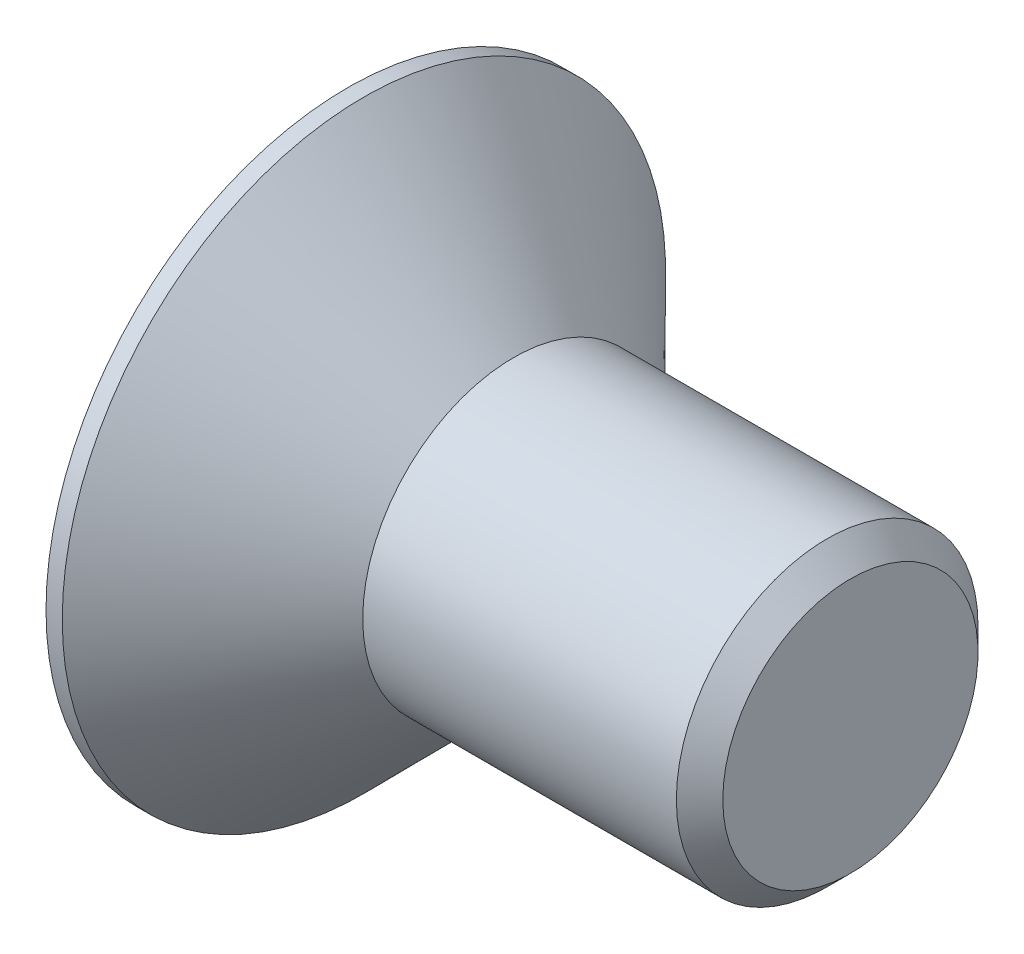
ISO-10303-21;
HEADER;
FILE_DESCRIPTION(('STEP AP214'),'2;1');
FILE_NAME('part.step','',(''),(''),'','','');
FILE_SCHEMA(('AUTOMOTIVE_DESIGN { 1 0 10303 214 1 1 1 1 }'));
ENDSEC;
DATA;
#1=APPLICATION_CONTEXT('core data for automotive mechanical design processes');
#2=APPLICATION_PROTOCOL_DEFINITION('international standard','automotive_design',2000,#1);
#3=PRODUCT_CONTEXT('',#1,'mechanical');
#4=PRODUCT('Part','Part','',(#3));
#5=PRODUCT_RELATED_PRODUCT_CATEGORY('part','',(#4));
#6=PRODUCT_DEFINITION_FORMATION('','',#4);
#7=PRODUCT_DEFINITION_CONTEXT('part definition',#1,'design');
#8=PRODUCT_DEFINITION('design','',#6,#7);
#9=PRODUCT_DEFINITION_SHAPE('','',#8);
#10=(LENGTH_UNIT() NAMED_UNIT(*) SI_UNIT(.MILLI.,.METRE.));
#11=(NAMED_UNIT(*) PLANE_ANGLE_UNIT() SI_UNIT($,.RADIAN.));
#12=(NAMED_UNIT(*) SI_UNIT($,.STERADIAN.) SOLID_ANGLE_UNIT());
#13=UNCERTAINTY_MEASURE_WITH_UNIT(LENGTH_MEASURE(1.E-05),#10,'distance_accuracy_value','');
#14=(GEOMETRIC_REPRESENTATION_CONTEXT(3) GLOBAL_UNCERTAINTY_ASSIGNED_CONTEXT((#13)) GLOBAL_UNIT_ASSIGNED_CONTEXT((#10,
#11,#12)) REPRESENTATION_CONTEXT('',''));
#15=CARTESIAN_POINT('',(0.,0.,0.));
#16=DIRECTION('',(0.,0.,1.));
#17=DIRECTION('',(1.,0.,0.));
#18=AXIS2_PLACEMENT_3D('',#15,#16,#17);
#19=CARTESIAN_POINT('',(0.,6.,0.));
#20=DIRECTION('',(1.,0.,0.));
#21=DIRECTION('',(0.,0.,-1.));
#22=AXIS2_PLACEMENT_3D('',#19,#20,#21);
#23=PLANE('',#22);
#24=CARTESIAN_POINT('',(0.,0.,0.));
#25=DIRECTION('',(-1.,0.,0.));
#26=DIRECTION('',(0.,0.,1.));
#27=AXIS2_PLACEMENT_3D('',#24,#25,#26);
#28=CIRCLE('',#27,6.);
#29=CARTESIAN_POINT('',(0.,0.,6.));
#30=VERTEX_POINT('',#29);
#31=EDGE_CURVE('E87',#30,#30,#28,.T.);
#32=ORIENTED_EDGE('',*,*,#31,.T.);
#33=EDGE_LOOP('',(#32));
#34=FACE_BOUND('',#33,.T.);
#35=DIRECTION('',(0.,0.5,0.866025403784438));
#36=VECTOR('',#35,1.);
#37=CARTESIAN_POINT('',(0.,-0.232050807568873,3.59807621135332));
#38=LINE('',#37,#36);
#39=CARTESIAN_POINT('',(0.,-2.30940107675851,0.));
#40=VERTEX_POINT('',#39);
#41=CARTESIAN_POINT('',(0.,-1.15470053837925,2.));
#42=VERTEX_POINT('',#41);
#43=EDGE_CURVE('E11',#40,#42,#38,.T.);
#44=ORIENTED_EDGE('',*,*,#43,.F.);
#45=DIRECTION('',(0.,-0.5,0.866025403784439));
#46=VECTOR('',#45,1.);
#47=CARTESIAN_POINT('',(0.,-0.23205080756888,-3.59807621135332));
#48=LINE('',#47,#46);
#49=CARTESIAN_POINT('',(0.,-1.15470053837925,-2.));
#50=VERTEX_POINT('',#49);
#51=EDGE_CURVE('E24',#50,#40,#48,.T.);
#52=ORIENTED_EDGE('',*,*,#51,.F.);
#53=DIRECTION('',(0.,-1.,0.));
#54=VECTOR('',#53,1.);
#55=CARTESIAN_POINT('',(0.,6.,-2.));
#56=LINE('',#55,#54);
#57=CARTESIAN_POINT('',(0.,1.15470053837925,-2.));
#58=VERTEX_POINT('',#57);
#59=EDGE_CURVE('E126',#58,#50,#56,.T.);
#60=ORIENTED_EDGE('',*,*,#59,.F.);
#61=DIRECTION('',(0.,-0.5,-0.866025403784439));
#62=VECTOR('',#61,1.);
#63=CARTESIAN_POINT('',(0.,3.23205080756888,1.59807621135331));
#64=LINE('',#63,#62);
#65=CARTESIAN_POINT('',(0.,2.30940107675851,0.));
#66=VERTEX_POINT('',#65);
#67=EDGE_CURVE('E123',#66,#58,#64,.T.);
#68=ORIENTED_EDGE('',*,*,#67,.F.);
#69=DIRECTION('',(0.,0.5,-0.866025403784439));
#70=VECTOR('',#69,1.);
#71=CARTESIAN_POINT('',(0.,3.23205080756888,-1.59807621135331));
#72=LINE('',#71,#70);
#73=CARTESIAN_POINT('',(0.,1.15470053837925,2.));
#74=VERTEX_POINT('',#73);
#75=EDGE_CURVE('E120',#74,#66,#72,.T.);
#76=ORIENTED_EDGE('',*,*,#75,.F.);
#77=DIRECTION('',(0.,1.,0.));
#78=VECTOR('',#77,1.);
#79=CARTESIAN_POINT('',(0.,6.,2.));
#80=LINE('',#79,#78);
#81=EDGE_CURVE('E117',#42,#74,#80,.T.);
#82=ORIENTED_EDGE('',*,*,#81,.F.);
#83=EDGE_LOOP('',(#44,#52,#60,#68,#76,#82));
#84=FACE_BOUND('',#83,.T.);
#85=ADVANCED_FACE('F16',(#34,#84),#23,.F.);
#86=CARTESIAN_POINT('',(10.,0.,0.));
#87=DIRECTION('',(-1.,0.,0.));
#88=DIRECTION('',(0.,0.,1.));
#89=AXIS2_PLACEMENT_3D('',#86,#87,#88);
#90=PLANE('',#89);
#91=CARTESIAN_POINT('',(10.,0.,0.));
#92=DIRECTION('',(-1.,0.,0.));
#93=DIRECTION('',(0.,0.,1.));
#94=AXIS2_PLACEMENT_3D('',#91,#92,#93);
#95=CIRCLE('',#94,2.53810623556582);
#96=CARTESIAN_POINT('',(10.,0.,2.53810623556582));
#97=VERTEX_POINT('',#96);
#98=EDGE_CURVE('E113',#97,#97,#95,.T.);
#99=ORIENTED_EDGE('',*,*,#98,.F.);
#100=EDGE_LOOP('',(#99));
#101=FACE_BOUND('',#100,.T.);
#102=ADVANCED_FACE('F138',(#101),#90,.F.);
#103=CARTESIAN_POINT('',(10.,0.,0.));
#104=DIRECTION('',(-1.,0.,0.));
#105=DIRECTION('',(0.,0.,1.));
#106=AXIS2_PLACEMENT_3D('',#103,#104,#105);
#107=CONICAL_SURFACE('',#106,2.53810623556582,0.78539816339745);
#108=CARTESIAN_POINT('',(9.53810623556582,0.,0.));
#109=DIRECTION('',(-1.,0.,0.));
#110=DIRECTION('',(0.,0.,1.));
#111=AXIS2_PLACEMENT_3D('',#108,#109,#110);
#112=CIRCLE('',#111,3.);
#113=CARTESIAN_POINT('',(9.53810623556582,0.,3.));
#114=VERTEX_POINT('',#113);
#115=EDGE_CURVE('E109',#114,#114,#112,.T.);
#116=ORIENTED_EDGE('',*,*,#115,.F.);
#117=EDGE_LOOP('',(#116));
#118=FACE_BOUND('',#117,.T.);
#119=ORIENTED_EDGE('',*,*,#98,.T.);
#120=EDGE_LOOP('',(#119));
#121=FACE_BOUND('',#120,.T.);
#122=ADVANCED_FACE('F142',(#118,#121),#107,.T.);
#123=CARTESIAN_POINT('',(0.,0.,0.));
#124=DIRECTION('',(-1.,0.,0.));
#125=DIRECTION('',(0.,0.,1.));
#126=AXIS2_PLACEMENT_3D('',#123,#124,#125);
#127=CYLINDRICAL_SURFACE('',#126,3.);
#128=CARTESIAN_POINT('',(3.3,0.,0.));
#129=DIRECTION('',(-1.,0.,0.));
#130=DIRECTION('',(0.,0.,1.));
#131=AXIS2_PLACEMENT_3D('',#128,#129,#130);
#132=CIRCLE('',#131,3.);
#133=CARTESIAN_POINT('',(3.3,0.,3.));
#134=VERTEX_POINT('',#133);
#135=EDGE_CURVE('E105',#134,#134,#132,.T.);
#136=ORIENTED_EDGE('',*,*,#135,.F.);
#137=EDGE_LOOP('',(#136));
#138=FACE_BOUND('',#137,.T.);
#139=ORIENTED_EDGE('',*,*,#115,.T.);
#140=EDGE_LOOP('',(#139));
#141=FACE_BOUND('',#140,.T.);
#142=ADVANCED_FACE('F154',(#138,#141),#127,.T.);
#143=CARTESIAN_POINT('',(3.3,0.,0.));
#144=DIRECTION('',(-1.,0.,0.));
#145=DIRECTION('',(0.,0.,1.));
#146=AXIS2_PLACEMENT_3D('',#143,#144,#145);
#147=CONICAL_SURFACE('',#146,3.,0.789300921896805);
#148=CARTESIAN_POINT('',(0.323325635103926,0.,0.));
#149=DIRECTION('',(-1.,0.,0.));
#150=DIRECTION('',(0.,0.,1.));
#151=AXIS2_PLACEMENT_3D('',#148,#149,#150);
#152=CIRCLE('',#151,6.);
#153=CARTESIAN_POINT('',(0.323325635103926,0.,6.));
#154=VERTEX_POINT('',#153);
#155=EDGE_CURVE('E95',#154,#154,#152,.T.);
#156=ORIENTED_EDGE('',*,*,#155,.F.);
#157=EDGE_LOOP('',(#156));
#158=FACE_BOUND('',#157,.T.);
#159=ORIENTED_EDGE('',*,*,#135,.T.);
#160=EDGE_LOOP('',(#159));
#161=FACE_BOUND('',#160,.T.);
#162=ADVANCED_FACE('F165',(#158,#161),#147,.T.);
#163=CARTESIAN_POINT('',(0.,0.,0.));
#164=DIRECTION('',(-1.,0.,0.));
#165=DIRECTION('',(0.,0.,1.));
#166=AXIS2_PLACEMENT_3D('',#163,#164,#165);
#167=CYLINDRICAL_SURFACE('',#166,6.);
#168=ORIENTED_EDGE('',*,*,#31,.F.);
#169=EDGE_LOOP('',(#168));
#170=FACE_BOUND('',#169,.T.);
#171=ORIENTED_EDGE('',*,*,#155,.T.);
#172=EDGE_LOOP('',(#171));
#173=FACE_BOUND('',#172,.T.);
#174=ADVANCED_FACE('F176',(#170,#173),#167,.T.);
#175=CARTESIAN_POINT('',(2.5,-1.15470053837925,2.));
#176=DIRECTION('',(0.,0.866025403784438,-0.5));
#177=DIRECTION('',(0.,0.5,0.866025403784438));
#178=AXIS2_PLACEMENT_3D('',#175,#176,#177);
#179=PLANE('',#178);
#180=ORIENTED_EDGE('',*,*,#43,.T.);
#181=DIRECTION('',(-1.,0.,0.));
#182=VECTOR('',#181,1.);
#183=CARTESIAN_POINT('',(2.5,-1.15470053837925,2.));
#184=LINE('',#183,#182);
#185=CARTESIAN_POINT('',(2.5,-1.15470053837925,2.));
#186=VERTEX_POINT('',#185);
#187=EDGE_CURVE('E31',#186,#42,#184,.T.);
#188=ORIENTED_EDGE('',*,*,#187,.F.);
#189=DIRECTION('',(0.,-0.5,-0.866025403784439));
#190=VECTOR('',#189,1.);
#191=CARTESIAN_POINT('',(2.5,-1.15470053837925,2.));
#192=LINE('',#191,#190);
#193=CARTESIAN_POINT('',(2.5,-2.30940107675851,0.));
#194=VERTEX_POINT('',#193);
#195=EDGE_CURVE('E73',#186,#194,#192,.T.);
#196=ORIENTED_EDGE('',*,*,#195,.T.);
#197=DIRECTION('',(-1.,0.,0.));
#198=VECTOR('',#197,1.);
#199=CARTESIAN_POINT('',(2.5,-2.30940107675851,0.));
#200=LINE('',#199,#198);
#201=EDGE_CURVE('E81',#194,#40,#200,.T.);
#202=ORIENTED_EDGE('',*,*,#201,.T.);
#203=EDGE_LOOP('',(#180,#188,#196,#202));
#204=FACE_BOUND('',#203,.T.);
#205=ADVANCED_FACE('F80',(#204),#179,.T.);
#206=CARTESIAN_POINT('',(2.5,-2.30940107675851,0.));
#207=DIRECTION('',(0.,0.866025403784439,0.5));
#208=DIRECTION('',(0.,-0.5,0.866025403784439));
#209=AXIS2_PLACEMENT_3D('',#206,#207,#208);
#210=PLANE('',#209);
#211=ORIENTED_EDGE('',*,*,#51,.T.);
#212=ORIENTED_EDGE('',*,*,#201,.F.);
#213=DIRECTION('',(0.,0.5,-0.866025403784439));
#214=VECTOR('',#213,1.);
#215=CARTESIAN_POINT('',(2.5,-2.30940107675851,0.));
#216=LINE('',#215,#214);
#217=CARTESIAN_POINT('',(2.5,-1.15470053837925,-2.));
#218=VERTEX_POINT('',#217);
#219=EDGE_CURVE('E69',#194,#218,#216,.T.);
#220=ORIENTED_EDGE('',*,*,#219,.T.);
#221=DIRECTION('',(-1.,0.,0.));
#222=VECTOR('',#221,1.);
#223=CARTESIAN_POINT('',(2.5,-1.15470053837925,-2.));
#224=LINE('',#223,#222);
#225=EDGE_CURVE('E88',#218,#50,#224,.T.);
#226=ORIENTED_EDGE('',*,*,#225,.T.);
#227=EDGE_LOOP('',(#211,#212,#220,#226));
#228=FACE_BOUND('',#227,.T.);
#229=ADVANCED_FACE('F85',(#228),#210,.T.);
#230=CARTESIAN_POINT('',(2.5,-1.15470053837925,-2.));
#231=DIRECTION('',(0.,0.,1.));
#232=DIRECTION('',(0.,-1.,0.));
#233=AXIS2_PLACEMENT_3D('',#230,#231,#232);
#234=PLANE('',#233);
#235=ORIENTED_EDGE('',*,*,#59,.T.);
#236=ORIENTED_EDGE('',*,*,#225,.F.);
#237=DIRECTION('',(0.,1.,0.));
#238=VECTOR('',#237,1.);
#239=CARTESIAN_POINT('',(2.5,-1.15470053837925,-2.));
#240=LINE('',#239,#238);
#241=CARTESIAN_POINT('',(2.5,1.15470053837925,-2.));
#242=VERTEX_POINT('',#241);
#243=EDGE_CURVE('E75',#218,#242,#240,.T.);
#244=ORIENTED_EDGE('',*,*,#243,.T.);
#245=DIRECTION('',(-1.,0.,0.));
#246=VECTOR('',#245,1.);
#247=CARTESIAN_POINT('',(2.5,1.15470053837925,-2.));
#248=LINE('',#247,#246);
#249=EDGE_CURVE('E98',#242,#58,#248,.T.);
#250=ORIENTED_EDGE('',*,*,#249,.T.);
#251=EDGE_LOOP('',(#235,#236,#244,#250));
#252=FACE_BOUND('',#251,.T.);
#253=ADVANCED_FACE('F225',(#252),#234,.T.);
#254=CARTESIAN_POINT('',(2.5,1.15470053837925,-2.));
#255=DIRECTION('',(0.,-0.866025403784438,0.5));
#256=DIRECTION('',(0.,-0.5,-0.866025403784439));
#257=AXIS2_PLACEMENT_3D('',#254,#255,#256);
#258=PLANE('',#257);
#259=ORIENTED_EDGE('',*,*,#67,.T.);
#260=ORIENTED_EDGE('',*,*,#249,.F.);
#261=DIRECTION('',(0.,0.5,0.866025403784439));
#262=VECTOR('',#261,1.);
#263=CARTESIAN_POINT('',(2.5,1.15470053837925,-2.));
#264=LINE('',#263,#262);
#265=CARTESIAN_POINT('',(2.5,2.30940107675851,0.));
#266=VERTEX_POINT('',#265);
#267=EDGE_CURVE('E238',#242,#266,#264,.T.);
#268=ORIENTED_EDGE('',*,*,#267,.T.);
#269=DIRECTION('',(-1.,0.,0.));
#270=VECTOR('',#269,1.);
#271=CARTESIAN_POINT('',(2.5,2.30940107675851,0.));
#272=LINE('',#271,#270);
#273=EDGE_CURVE('E209',#266,#66,#272,.T.);
#274=ORIENTED_EDGE('',*,*,#273,.T.);
#275=EDGE_LOOP('',(#259,#260,#268,#274));
#276=FACE_BOUND('',#275,.T.);
#277=ADVANCED_FACE('F250',(#276),#258,.T.);
#278=CARTESIAN_POINT('',(2.5,2.30940107675851,0.));
#279=DIRECTION('',(0.,-0.866025403784439,-0.5));
#280=DIRECTION('',(0.,0.5,-0.866025403784439));
#281=AXIS2_PLACEMENT_3D('',#278,#279,#280);
#282=PLANE('',#281);
#283=ORIENTED_EDGE('',*,*,#75,.T.);
#284=ORIENTED_EDGE('',*,*,#273,.F.);
#285=DIRECTION('',(0.,-0.5,0.866025403784439));
#286=VECTOR('',#285,1.);
#287=CARTESIAN_POINT('',(2.5,2.30940107675851,0.));
#288=LINE('',#287,#286);
#289=CARTESIAN_POINT('',(2.5,1.15470053837925,2.));
#290=VERTEX_POINT('',#289);
#291=EDGE_CURVE('E212',#266,#290,#288,.T.);
#292=ORIENTED_EDGE('',*,*,#291,.T.);
#293=DIRECTION('',(-1.,0.,0.));
#294=VECTOR('',#293,1.);
#295=CARTESIAN_POINT('',(2.5,1.15470053837925,2.));
#296=LINE('',#295,#294);
#297=EDGE_CURVE('E203',#290,#74,#296,.T.);
#298=ORIENTED_EDGE('',*,*,#297,.T.);
#299=EDGE_LOOP('',(#283,#284,#292,#298));
#300=FACE_BOUND('',#299,.T.);
#301=ADVANCED_FACE('F234',(#300),#282,.T.);
#302=CARTESIAN_POINT('',(2.5,1.15470053837925,2.));
#303=DIRECTION('',(0.,0.,-1.));
#304=DIRECTION('',(0.,1.,0.));
#305=AXIS2_PLACEMENT_3D('',#302,#303,#304);
#306=PLANE('',#305);
#307=ORIENTED_EDGE('',*,*,#81,.T.);
#308=ORIENTED_EDGE('',*,*,#297,.F.);
#309=DIRECTION('',(0.,-1.,0.));
#310=VECTOR('',#309,1.);
#311=CARTESIAN_POINT('',(2.5,1.15470053837925,2.));
#312=LINE('',#311,#310);
#313=EDGE_CURVE('E204',#290,#186,#312,.T.);
#314=ORIENTED_EDGE('',*,*,#313,.T.);
#315=ORIENTED_EDGE('',*,*,#187,.T.);
#316=EDGE_LOOP('',(#307,#308,#314,#315));
#317=FACE_BOUND('',#316,.T.);
#318=ADVANCED_FACE('F232',(#317),#306,.T.);
#319=CARTESIAN_POINT('',(2.5,-2.30940107675851,0.));
#320=DIRECTION('',(1.,0.,0.));
#321=DIRECTION('',(0.,0.,1.));
#322=AXIS2_PLACEMENT_3D('',#319,#320,#321);
#323=PLANE('',#322);
#324=ORIENTED_EDGE('',*,*,#195,.F.);
#325=ORIENTED_EDGE('',*,*,#313,.F.);
#326=ORIENTED_EDGE('',*,*,#291,.F.);
#327=ORIENTED_EDGE('',*,*,#267,.F.);
#328=ORIENTED_EDGE('',*,*,#243,.F.);
#329=ORIENTED_EDGE('',*,*,#219,.F.);
#330=EDGE_LOOP('',(#324,#325,#326,#327,#328,#329));
#331=FACE_BOUND('',#330,.T.);
#332=ADVANCED_FACE('F71',(#331),#323,.F.);
#333=CLOSED_SHELL('',(#85,#102,#122,#142,#162,#174,#205,#229,#253,#277,#301,#318,#332));
#334=MANIFOLD_SOLID_BREP('B1',#333);
#335=ADVANCED_BREP_SHAPE_REPRESENTATION('',(#18,#334),#14);
#336=SHAPE_DEFINITION_REPRESENTATION(#9,#335);
ENDSEC;
END-ISO-10303-21;
